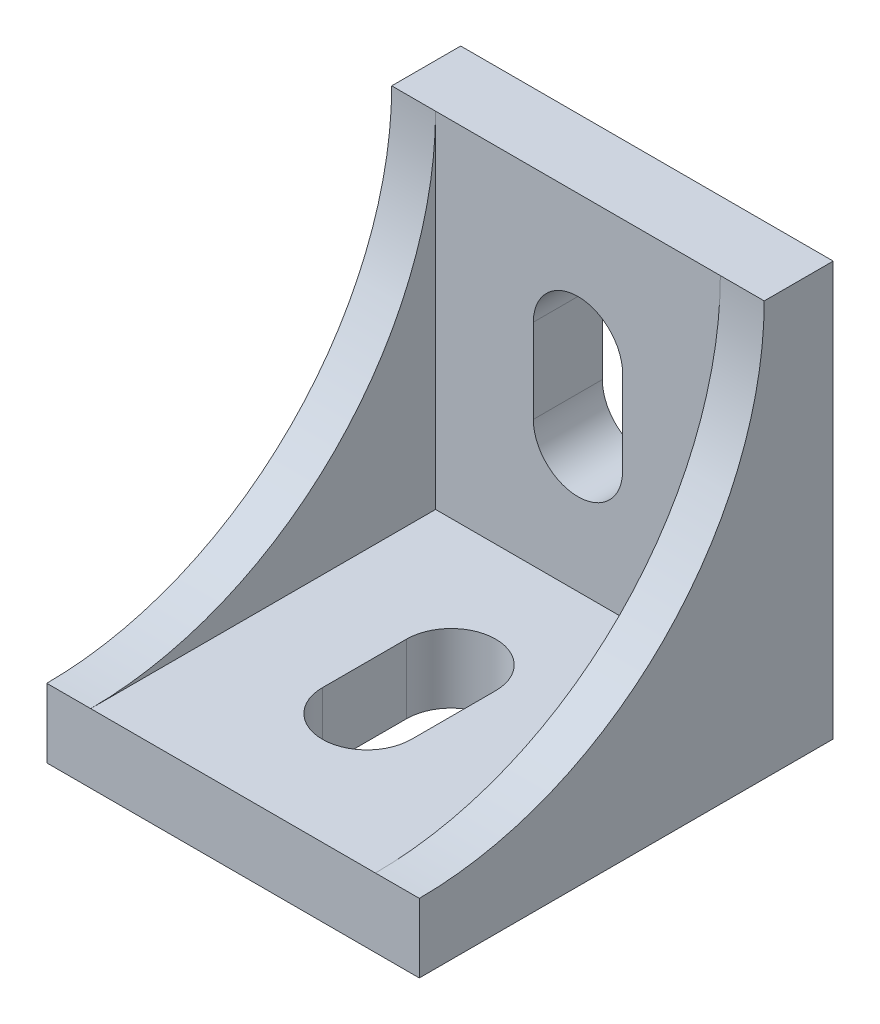
ISO-10303-21;
HEADER;
FILE_DESCRIPTION(('STEP AP214'),'2;1');
FILE_NAME('part.step','',(''),(''),'','','');
FILE_SCHEMA(('AUTOMOTIVE_DESIGN { 1 0 10303 214 1 1 1 1 }'));
ENDSEC;
DATA;
#1=APPLICATION_CONTEXT('core data for automotive mechanical design processes');
#2=APPLICATION_PROTOCOL_DEFINITION('international standard','automotive_design',2000,#1);
#3=PRODUCT_CONTEXT('',#1,'mechanical');
#4=PRODUCT('Part','Part','',(#3));
#5=PRODUCT_RELATED_PRODUCT_CATEGORY('part','',(#4));
#6=PRODUCT_DEFINITION_FORMATION('','',#4);
#7=PRODUCT_DEFINITION_CONTEXT('part definition',#1,'design');
#8=PRODUCT_DEFINITION('design','',#6,#7);
#9=PRODUCT_DEFINITION_SHAPE('','',#8);
#10=(LENGTH_UNIT() NAMED_UNIT(*) SI_UNIT(.MILLI.,.METRE.));
#11=(NAMED_UNIT(*) PLANE_ANGLE_UNIT() SI_UNIT($,.RADIAN.));
#12=(NAMED_UNIT(*) SI_UNIT($,.STERADIAN.) SOLID_ANGLE_UNIT());
#13=UNCERTAINTY_MEASURE_WITH_UNIT(LENGTH_MEASURE(1.E-05),#10,'distance_accuracy_value','');
#14=(GEOMETRIC_REPRESENTATION_CONTEXT(3) GLOBAL_UNCERTAINTY_ASSIGNED_CONTEXT((#13)) GLOBAL_UNIT_ASSIGNED_CONTEXT((#10,
#11,#12)) REPRESENTATION_CONTEXT('',''));
#15=CARTESIAN_POINT('',(0.,0.,0.));
#16=DIRECTION('',(0.,0.,1.));
#17=DIRECTION('',(1.,0.,0.));
#18=AXIS2_PLACEMENT_3D('',#15,#16,#17);
#19=CARTESIAN_POINT('',(-13.5,30.,-15.));
#20=DIRECTION('',(0.,0.,1.));
#21=DIRECTION('',(1.,0.,0.));
#22=AXIS2_PLACEMENT_3D('',#19,#20,#21);
#23=PLANE('',#22);
#24=DIRECTION('',(0.,-1.,0.));
#25=VECTOR('',#24,1.);
#26=CARTESIAN_POINT('',(3.,30.,-15.));
#27=LINE('',#26,#25);
#28=CARTESIAN_POINT('',(3.,26.9,-15.));
#29=VERTEX_POINT('',#28);
#30=CARTESIAN_POINT('',(3.,24.8,-15.));
#31=VERTEX_POINT('',#30);
#32=EDGE_CURVE('E512',#29,#31,#27,.T.);
#33=ORIENTED_EDGE('',*,*,#32,.F.);
#34=DIRECTION('',(1.,0.,0.));
#35=VECTOR('',#34,1.);
#36=CARTESIAN_POINT('',(-13.5,26.9,-15.));
#37=LINE('',#36,#35);
#38=CARTESIAN_POINT('',(-3.,26.9,-15.));
#39=VERTEX_POINT('',#38);
#40=EDGE_CURVE('E509',#39,#29,#37,.T.);
#41=ORIENTED_EDGE('',*,*,#40,.F.);
#42=DIRECTION('',(0.,1.,0.));
#43=VECTOR('',#42,1.);
#44=CARTESIAN_POINT('',(-3.,30.,-15.));
#45=LINE('',#44,#43);
#46=CARTESIAN_POINT('',(-3.,24.8,-15.));
#47=VERTEX_POINT('',#46);
#48=EDGE_CURVE('E506',#47,#39,#45,.T.);
#49=ORIENTED_EDGE('',*,*,#48,.F.);
#50=DIRECTION('',(-1.,0.,0.));
#51=VECTOR('',#50,1.);
#52=CARTESIAN_POINT('',(-13.5,24.8,-15.));
#53=LINE('',#52,#51);
#54=EDGE_CURVE('E503',#31,#47,#53,.T.);
#55=ORIENTED_EDGE('',*,*,#54,.F.);
#56=EDGE_LOOP('',(#33,#41,#49,#55));
#57=FACE_BOUND('',#56,.T.);
#58=DIRECTION('',(-1.,0.,0.));
#59=VECTOR('',#58,1.);
#60=CARTESIAN_POINT('',(-13.5,0.,-15.));
#61=LINE('',#60,#59);
#62=CARTESIAN_POINT('',(13.5,0.,-15.));
#63=VERTEX_POINT('',#62);
#64=CARTESIAN_POINT('',(-13.5,0.,-15.));
#65=VERTEX_POINT('',#64);
#66=EDGE_CURVE('E460',#63,#65,#61,.T.);
#67=ORIENTED_EDGE('',*,*,#66,.T.);
#68=DIRECTION('',(0.,-1.,0.));
#69=VECTOR('',#68,1.);
#70=CARTESIAN_POINT('',(-13.5,30.,-15.));
#71=LINE('',#70,#69);
#72=CARTESIAN_POINT('',(-13.5,30.,-15.));
#73=VERTEX_POINT('',#72);
#74=EDGE_CURVE('E470',#73,#65,#71,.T.);
#75=ORIENTED_EDGE('',*,*,#74,.F.);
#76=DIRECTION('',(-1.,0.,0.));
#77=VECTOR('',#76,1.);
#78=CARTESIAN_POINT('',(-13.5,30.,-15.));
#79=LINE('',#78,#77);
#80=CARTESIAN_POINT('',(13.5,30.,-15.));
#81=VERTEX_POINT('',#80);
#82=EDGE_CURVE('E451',#81,#73,#79,.T.);
#83=ORIENTED_EDGE('',*,*,#82,.F.);
#84=DIRECTION('',(0.,-1.,0.));
#85=VECTOR('',#84,1.);
#86=CARTESIAN_POINT('',(13.5,30.,-15.));
#87=LINE('',#86,#85);
#88=EDGE_CURVE('E473',#81,#63,#87,.T.);
#89=ORIENTED_EDGE('',*,*,#88,.T.);
#90=EDGE_LOOP('',(#67,#75,#83,#89));
#91=FACE_BOUND('',#90,.T.);
#92=DIRECTION('',(0.,-1.,0.));
#93=VECTOR('',#92,1.);
#94=CARTESIAN_POINT('',(3.235,14.195,-15.));
#95=LINE('',#94,#93);
#96=CARTESIAN_POINT('',(3.235,20.295,-15.));
#97=VERTEX_POINT('',#96);
#98=CARTESIAN_POINT('',(3.235,14.195,-15.));
#99=VERTEX_POINT('',#98);
#100=EDGE_CURVE('E371',#97,#99,#95,.T.);
#101=ORIENTED_EDGE('',*,*,#100,.F.);
#102=CARTESIAN_POINT('',(0.,20.295,-15.));
#103=DIRECTION('',(0.,0.,1.));
#104=DIRECTION('',(1.,0.,0.));
#105=AXIS2_PLACEMENT_3D('',#102,#103,#104);
#106=CIRCLE('',#105,3.235);
#107=CARTESIAN_POINT('',(-3.235,20.295,-15.));
#108=VERTEX_POINT('',#107);
#109=EDGE_CURVE('E373',#108,#97,#106,.F.);
#110=ORIENTED_EDGE('',*,*,#109,.F.);
#111=DIRECTION('',(0.,1.,0.));
#112=VECTOR('',#111,1.);
#113=CARTESIAN_POINT('',(-3.235,14.195,-15.));
#114=LINE('',#113,#112);
#115=CARTESIAN_POINT('',(-3.235,14.195,-15.));
#116=VERTEX_POINT('',#115);
#117=EDGE_CURVE('E365',#116,#108,#114,.T.);
#118=ORIENTED_EDGE('',*,*,#117,.F.);
#119=CARTESIAN_POINT('',(0.,14.195,-15.));
#120=DIRECTION('',(0.,0.,1.));
#121=DIRECTION('',(1.,0.,0.));
#122=AXIS2_PLACEMENT_3D('',#119,#120,#121);
#123=CIRCLE('',#122,3.235);
#124=EDGE_CURVE('E368',#99,#116,#123,.F.);
#125=ORIENTED_EDGE('',*,*,#124,.F.);
#126=EDGE_LOOP('',(#101,#110,#118,#125));
#127=FACE_BOUND('',#126,.T.);
#128=DIRECTION('',(0.,-1.,0.));
#129=VECTOR('',#128,1.);
#130=CARTESIAN_POINT('',(3.,30.,-15.));
#131=LINE('',#130,#129);
#132=CARTESIAN_POINT('',(3.,5.48,-15.));
#133=VERTEX_POINT('',#132);
#134=CARTESIAN_POINT('',(3.,3.38,-15.));
#135=VERTEX_POINT('',#134);
#136=EDGE_CURVE('E12',#133,#135,#131,.T.);
#137=ORIENTED_EDGE('',*,*,#136,.F.);
#138=DIRECTION('',(1.,0.,0.));
#139=VECTOR('',#138,1.);
#140=CARTESIAN_POINT('',(-13.5,5.48,-15.));
#141=LINE('',#140,#139);
#142=CARTESIAN_POINT('',(-3.,5.48,-15.));
#143=VERTEX_POINT('',#142);
#144=EDGE_CURVE('E45',#143,#133,#141,.T.);
#145=ORIENTED_EDGE('',*,*,#144,.F.);
#146=DIRECTION('',(0.,1.,0.));
#147=VECTOR('',#146,1.);
#148=CARTESIAN_POINT('',(-3.,30.,-15.));
#149=LINE('',#148,#147);
#150=CARTESIAN_POINT('',(-3.,3.38,-15.));
#151=VERTEX_POINT('',#150);
#152=EDGE_CURVE('E518',#151,#143,#149,.T.);
#153=ORIENTED_EDGE('',*,*,#152,.F.);
#154=DIRECTION('',(-1.,0.,0.));
#155=VECTOR('',#154,1.);
#156=CARTESIAN_POINT('',(-13.5,3.38,-15.));
#157=LINE('',#156,#155);
#158=EDGE_CURVE('E515',#135,#151,#157,.T.);
#159=ORIENTED_EDGE('',*,*,#158,.F.);
#160=EDGE_LOOP('',(#137,#145,#153,#159));
#161=FACE_BOUND('',#160,.T.);
#162=ADVANCED_FACE('F37',(#57,#91,#127,#161),#23,.F.);
#163=CARTESIAN_POINT('',(0.,0.,0.));
#164=DIRECTION('',(0.,-1.,0.));
#165=DIRECTION('',(0.,0.,-1.));
#166=AXIS2_PLACEMENT_3D('',#163,#164,#165);
#167=PLANE('',#166);
#168=CARTESIAN_POINT('',(0.,0.,-0.805000000000004));
#169=DIRECTION('',(0.,1.,0.));
#170=DIRECTION('',(0.,0.,1.));
#171=AXIS2_PLACEMENT_3D('',#168,#169,#170);
#172=CIRCLE('',#171,3.235);
#173=CARTESIAN_POINT('',(3.235,0.,-0.805000000000004));
#174=VERTEX_POINT('',#173);
#175=CARTESIAN_POINT('',(-3.235,0.,-0.805000000000004));
#176=VERTEX_POINT('',#175);
#177=EDGE_CURVE('E333',#174,#176,#172,.T.);
#178=ORIENTED_EDGE('',*,*,#177,.T.);
#179=DIRECTION('',(0.,0.,1.));
#180=VECTOR('',#179,1.);
#181=CARTESIAN_POINT('',(-3.235,0.,-0.805000000000004));
#182=LINE('',#181,#180);
#183=CARTESIAN_POINT('',(-3.235,0.,5.29499999999999));
#184=VERTEX_POINT('',#183);
#185=EDGE_CURVE('E336',#176,#184,#182,.T.);
#186=ORIENTED_EDGE('',*,*,#185,.T.);
#187=CARTESIAN_POINT('',(0.,0.,5.295));
#188=DIRECTION('',(0.,1.,0.));
#189=DIRECTION('',(0.,0.,1.));
#190=AXIS2_PLACEMENT_3D('',#187,#188,#189);
#191=CIRCLE('',#190,3.235);
#192=CARTESIAN_POINT('',(3.235,0.,5.295));
#193=VERTEX_POINT('',#192);
#194=EDGE_CURVE('E340',#184,#193,#191,.T.);
#195=ORIENTED_EDGE('',*,*,#194,.T.);
#196=DIRECTION('',(0.,0.,-1.));
#197=VECTOR('',#196,1.);
#198=CARTESIAN_POINT('',(3.235,0.,-0.805000000000004));
#199=LINE('',#198,#197);
#200=EDGE_CURVE('E343',#193,#174,#199,.T.);
#201=ORIENTED_EDGE('',*,*,#200,.T.);
#202=EDGE_LOOP('',(#178,#186,#195,#201));
#203=FACE_BOUND('',#202,.T.);
#204=DIRECTION('',(0.,0.,-1.));
#205=VECTOR('',#204,1.);
#206=CARTESIAN_POINT('',(13.5,0.,15.));
#207=LINE('',#206,#205);
#208=CARTESIAN_POINT('',(13.5,0.,15.));
#209=VERTEX_POINT('',#208);
#210=EDGE_CURVE('E448',#209,#63,#207,.T.);
#211=ORIENTED_EDGE('',*,*,#210,.F.);
#212=DIRECTION('',(1.,0.,0.));
#213=VECTOR('',#212,1.);
#214=CARTESIAN_POINT('',(-13.5,0.,15.));
#215=LINE('',#214,#213);
#216=CARTESIAN_POINT('',(-13.5,0.,15.));
#217=VERTEX_POINT('',#216);
#218=EDGE_CURVE('E452',#217,#209,#215,.T.);
#219=ORIENTED_EDGE('',*,*,#218,.F.);
#220=DIRECTION('',(0.,0.,1.));
#221=VECTOR('',#220,1.);
#222=CARTESIAN_POINT('',(-13.5,0.,15.));
#223=LINE('',#222,#221);
#224=EDGE_CURVE('E462',#65,#217,#223,.T.);
#225=ORIENTED_EDGE('',*,*,#224,.F.);
#226=ORIENTED_EDGE('',*,*,#66,.F.);
#227=EDGE_LOOP('',(#211,#219,#225,#226));
#228=FACE_BOUND('',#227,.T.);
#229=DIRECTION('',(1.,0.,0.));
#230=VECTOR('',#229,1.);
#231=CARTESIAN_POINT('',(0.,0.,11.9));
#232=LINE('',#231,#230);
#233=CARTESIAN_POINT('',(-3.,0.,11.9));
#234=VERTEX_POINT('',#233);
#235=CARTESIAN_POINT('',(3.,0.,11.9));
#236=VERTEX_POINT('',#235);
#237=EDGE_CURVE('E485',#234,#236,#232,.T.);
#238=ORIENTED_EDGE('',*,*,#237,.T.);
#239=DIRECTION('',(0.,0.,-1.));
#240=VECTOR('',#239,1.);
#241=CARTESIAN_POINT('',(3.,0.,0.));
#242=LINE('',#241,#240);
#243=CARTESIAN_POINT('',(3.,0.,9.8));
#244=VERTEX_POINT('',#243);
#245=EDGE_CURVE('E488',#236,#244,#242,.T.);
#246=ORIENTED_EDGE('',*,*,#245,.T.);
#247=DIRECTION('',(-1.,0.,0.));
#248=VECTOR('',#247,1.);
#249=CARTESIAN_POINT('',(0.,0.,9.8));
#250=LINE('',#249,#248);
#251=CARTESIAN_POINT('',(-3.,0.,9.8));
#252=VERTEX_POINT('',#251);
#253=EDGE_CURVE('E479',#244,#252,#250,.T.);
#254=ORIENTED_EDGE('',*,*,#253,.T.);
#255=DIRECTION('',(0.,0.,1.));
#256=VECTOR('',#255,1.);
#257=CARTESIAN_POINT('',(-3.,0.,0.));
#258=LINE('',#257,#256);
#259=EDGE_CURVE('E482',#252,#234,#258,.T.);
#260=ORIENTED_EDGE('',*,*,#259,.T.);
#261=EDGE_LOOP('',(#238,#246,#254,#260));
#262=FACE_BOUND('',#261,.T.);
#263=DIRECTION('',(1.,0.,0.));
#264=VECTOR('',#263,1.);
#265=CARTESIAN_POINT('',(0.,0.,-9.52));
#266=LINE('',#265,#264);
#267=CARTESIAN_POINT('',(-3.,0.,-9.52));
#268=VERTEX_POINT('',#267);
#269=CARTESIAN_POINT('',(3.,0.,-9.52));
#270=VERTEX_POINT('',#269);
#271=EDGE_CURVE('E497',#268,#270,#266,.T.);
#272=ORIENTED_EDGE('',*,*,#271,.T.);
#273=DIRECTION('',(0.,0.,-1.));
#274=VECTOR('',#273,1.);
#275=CARTESIAN_POINT('',(3.,0.,0.));
#276=LINE('',#275,#274);
#277=CARTESIAN_POINT('',(3.,0.,-11.62));
#278=VERTEX_POINT('',#277);
#279=EDGE_CURVE('E500',#270,#278,#276,.T.);
#280=ORIENTED_EDGE('',*,*,#279,.T.);
#281=DIRECTION('',(-1.,0.,0.));
#282=VECTOR('',#281,1.);
#283=CARTESIAN_POINT('',(0.,0.,-11.62));
#284=LINE('',#283,#282);
#285=CARTESIAN_POINT('',(-3.,0.,-11.62));
#286=VERTEX_POINT('',#285);
#287=EDGE_CURVE('E491',#278,#286,#284,.T.);
#288=ORIENTED_EDGE('',*,*,#287,.T.);
#289=DIRECTION('',(0.,0.,1.));
#290=VECTOR('',#289,1.);
#291=CARTESIAN_POINT('',(-3.,0.,0.));
#292=LINE('',#291,#290);
#293=EDGE_CURVE('E494',#286,#268,#292,.T.);
#294=ORIENTED_EDGE('',*,*,#293,.T.);
#295=EDGE_LOOP('',(#272,#280,#288,#294));
#296=FACE_BOUND('',#295,.T.);
#297=ADVANCED_FACE('F533',(#203,#228,#262,#296),#167,.T.);
#298=CARTESIAN_POINT('',(13.5,30.,15.));
#299=DIRECTION('',(-1.,0.,0.));
#300=DIRECTION('',(0.,0.,1.));
#301=AXIS2_PLACEMENT_3D('',#298,#299,#300);
#302=PLANE('',#301);
#303=DIRECTION('',(0.,0.,-1.));
#304=VECTOR('',#303,1.);
#305=CARTESIAN_POINT('',(13.5,30.,15.));
#306=LINE('',#305,#304);
#307=CARTESIAN_POINT('',(13.5,30.,-10.));
#308=VERTEX_POINT('',#307);
#309=EDGE_CURVE('E449',#308,#81,#306,.T.);
#310=ORIENTED_EDGE('',*,*,#309,.F.);
#311=CARTESIAN_POINT('',(13.5,30.,15.));
#312=DIRECTION('',(1.,0.,0.));
#313=DIRECTION('',(0.,0.,1.));
#314=AXIS2_PLACEMENT_3D('',#311,#312,#313);
#315=CIRCLE('',#314,25.);
#316=CARTESIAN_POINT('',(13.5,5.,15.));
#317=VERTEX_POINT('',#316);
#318=EDGE_CURVE('E412',#317,#308,#315,.T.);
#319=ORIENTED_EDGE('',*,*,#318,.F.);
#320=DIRECTION('',(0.,-1.,0.));
#321=VECTOR('',#320,1.);
#322=CARTESIAN_POINT('',(13.5,30.,15.));
#323=LINE('',#322,#321);
#324=EDGE_CURVE('E457',#317,#209,#323,.T.);
#325=ORIENTED_EDGE('',*,*,#324,.T.);
#326=ORIENTED_EDGE('',*,*,#210,.T.);
#327=ORIENTED_EDGE('',*,*,#88,.F.);
#328=EDGE_LOOP('',(#310,#319,#325,#326,#327));
#329=FACE_BOUND('',#328,.T.);
#330=ADVANCED_FACE('F39',(#329),#302,.F.);
#331=CARTESIAN_POINT('',(-13.5,30.,15.));
#332=DIRECTION('',(1.,0.,0.));
#333=DIRECTION('',(0.,0.,-1.));
#334=AXIS2_PLACEMENT_3D('',#331,#332,#333);
#335=PLANE('',#334);
#336=DIRECTION('',(0.,-1.,0.));
#337=VECTOR('',#336,1.);
#338=CARTESIAN_POINT('',(-13.5,30.,15.));
#339=LINE('',#338,#337);
#340=CARTESIAN_POINT('',(-13.5,5.,15.));
#341=VERTEX_POINT('',#340);
#342=EDGE_CURVE('E468',#341,#217,#339,.T.);
#343=ORIENTED_EDGE('',*,*,#342,.F.);
#344=CARTESIAN_POINT('',(-13.5,30.,15.));
#345=DIRECTION('',(1.,0.,0.));
#346=DIRECTION('',(0.,0.,1.));
#347=AXIS2_PLACEMENT_3D('',#344,#345,#346);
#348=CIRCLE('',#347,25.);
#349=CARTESIAN_POINT('',(-13.5,30.,-10.));
#350=VERTEX_POINT('',#349);
#351=EDGE_CURVE('E414',#341,#350,#348,.T.);
#352=ORIENTED_EDGE('',*,*,#351,.T.);
#353=DIRECTION('',(0.,0.,1.));
#354=VECTOR('',#353,1.);
#355=CARTESIAN_POINT('',(-13.5,30.,15.));
#356=LINE('',#355,#354);
#357=EDGE_CURVE('E454',#73,#350,#356,.T.);
#358=ORIENTED_EDGE('',*,*,#357,.F.);
#359=ORIENTED_EDGE('',*,*,#74,.T.);
#360=ORIENTED_EDGE('',*,*,#224,.T.);
#361=EDGE_LOOP('',(#343,#352,#358,#359,#360));
#362=FACE_BOUND('',#361,.T.);
#363=ADVANCED_FACE('F542',(#362),#335,.F.);
#364=CARTESIAN_POINT('',(-13.5,30.,15.));
#365=DIRECTION('',(0.,0.,-1.));
#366=DIRECTION('',(-1.,0.,0.));
#367=AXIS2_PLACEMENT_3D('',#364,#365,#366);
#368=PLANE('',#367);
#369=ORIENTED_EDGE('',*,*,#324,.F.);
#370=DIRECTION('',(1.,0.,0.));
#371=VECTOR('',#370,1.);
#372=CARTESIAN_POINT('',(-13.5,5.,15.));
#373=LINE('',#372,#371);
#374=CARTESIAN_POINT('',(10.32,5.,15.));
#375=VERTEX_POINT('',#374);
#376=EDGE_CURVE('E417',#375,#317,#373,.T.);
#377=ORIENTED_EDGE('',*,*,#376,.F.);
#378=DIRECTION('',(1.,0.,0.));
#379=VECTOR('',#378,1.);
#380=CARTESIAN_POINT('',(-10.32,5.,15.));
#381=LINE('',#380,#379);
#382=CARTESIAN_POINT('',(-10.32,5.,15.));
#383=VERTEX_POINT('',#382);
#384=EDGE_CURVE('E438',#383,#375,#381,.T.);
#385=ORIENTED_EDGE('',*,*,#384,.F.);
#386=EDGE_CURVE('E423',#341,#383,#373,.T.);
#387=ORIENTED_EDGE('',*,*,#386,.F.);
#388=ORIENTED_EDGE('',*,*,#342,.T.);
#389=ORIENTED_EDGE('',*,*,#218,.T.);
#390=EDGE_LOOP('',(#369,#377,#385,#387,#388,#389));
#391=FACE_BOUND('',#390,.T.);
#392=ADVANCED_FACE('F545',(#391),#368,.F.);
#393=CARTESIAN_POINT('',(0.,30.,0.));
#394=DIRECTION('',(0.,-1.,0.));
#395=DIRECTION('',(0.,0.,-1.));
#396=AXIS2_PLACEMENT_3D('',#393,#394,#395);
#397=PLANE('',#396);
#398=ORIENTED_EDGE('',*,*,#357,.T.);
#399=DIRECTION('',(1.,0.,0.));
#400=VECTOR('',#399,1.);
#401=CARTESIAN_POINT('',(-13.5,30.,-10.));
#402=LINE('',#401,#400);
#403=CARTESIAN_POINT('',(-10.32,30.,-10.));
#404=VERTEX_POINT('',#403);
#405=EDGE_CURVE('E418',#350,#404,#402,.T.);
#406=ORIENTED_EDGE('',*,*,#405,.T.);
#407=DIRECTION('',(-1.,0.,0.));
#408=VECTOR('',#407,1.);
#409=CARTESIAN_POINT('',(-10.32,30.,-10.));
#410=LINE('',#409,#408);
#411=CARTESIAN_POINT('',(10.32,30.,-9.99999999999999));
#412=VERTEX_POINT('',#411);
#413=EDGE_CURVE('E427',#412,#404,#410,.T.);
#414=ORIENTED_EDGE('',*,*,#413,.F.);
#415=EDGE_CURVE('E422',#412,#308,#402,.T.);
#416=ORIENTED_EDGE('',*,*,#415,.T.);
#417=ORIENTED_EDGE('',*,*,#309,.T.);
#418=ORIENTED_EDGE('',*,*,#82,.T.);
#419=EDGE_LOOP('',(#398,#406,#414,#416,#417,#418));
#420=FACE_BOUND('',#419,.T.);
#421=ADVANCED_FACE('F548',(#420),#397,.F.);
#422=CARTESIAN_POINT('',(0.,5.,0.));
#423=DIRECTION('',(0.,-1.,0.));
#424=DIRECTION('',(0.,0.,-1.));
#425=AXIS2_PLACEMENT_3D('',#422,#423,#424);
#426=PLANE('',#425);
#427=DIRECTION('',(0.,0.,1.));
#428=VECTOR('',#427,1.);
#429=CARTESIAN_POINT('',(-3.235,5.,-0.805000000000004));
#430=LINE('',#429,#428);
#431=CARTESIAN_POINT('',(-3.235,5.,-0.805000000000004));
#432=VERTEX_POINT('',#431);
#433=CARTESIAN_POINT('',(-3.235,5.,5.29499999999999));
#434=VERTEX_POINT('',#433);
#435=EDGE_CURVE('E348',#432,#434,#430,.T.);
#436=ORIENTED_EDGE('',*,*,#435,.F.);
#437=CARTESIAN_POINT('',(0.,5.,-0.805000000000004));
#438=DIRECTION('',(0.,1.,0.));
#439=DIRECTION('',(0.,0.,1.));
#440=AXIS2_PLACEMENT_3D('',#437,#438,#439);
#441=CIRCLE('',#440,3.235);
#442=CARTESIAN_POINT('',(3.235,5.,-0.805000000000004));
#443=VERTEX_POINT('',#442);
#444=EDGE_CURVE('E332',#443,#432,#441,.T.);
#445=ORIENTED_EDGE('',*,*,#444,.F.);
#446=DIRECTION('',(0.,0.,-1.));
#447=VECTOR('',#446,1.);
#448=CARTESIAN_POINT('',(3.235,5.,-0.805000000000004));
#449=LINE('',#448,#447);
#450=CARTESIAN_POINT('',(3.235,5.,5.295));
#451=VERTEX_POINT('',#450);
#452=EDGE_CURVE('E337',#451,#443,#449,.T.);
#453=ORIENTED_EDGE('',*,*,#452,.F.);
#454=CARTESIAN_POINT('',(0.,5.,5.295));
#455=DIRECTION('',(0.,1.,0.));
#456=DIRECTION('',(0.,0.,1.));
#457=AXIS2_PLACEMENT_3D('',#454,#455,#456);
#458=CIRCLE('',#457,3.235);
#459=EDGE_CURVE('E351',#434,#451,#458,.T.);
#460=ORIENTED_EDGE('',*,*,#459,.F.);
#461=EDGE_LOOP('',(#436,#445,#453,#460));
#462=FACE_BOUND('',#461,.T.);
#463=DIRECTION('',(0.,0.,-1.));
#464=VECTOR('',#463,1.);
#465=CARTESIAN_POINT('',(10.32,5.,-9.99999999999999));
#466=LINE('',#465,#464);
#467=CARTESIAN_POINT('',(10.32,5.,-9.99999999999999));
#468=VERTEX_POINT('',#467);
#469=EDGE_CURVE('E434',#375,#468,#466,.T.);
#470=ORIENTED_EDGE('',*,*,#469,.T.);
#471=DIRECTION('',(-1.,0.,0.));
#472=VECTOR('',#471,1.);
#473=CARTESIAN_POINT('',(-10.32,5.,-10.));
#474=LINE('',#473,#472);
#475=CARTESIAN_POINT('',(-10.32,5.,-10.));
#476=VERTEX_POINT('',#475);
#477=EDGE_CURVE('E430',#468,#476,#474,.T.);
#478=ORIENTED_EDGE('',*,*,#477,.T.);
#479=DIRECTION('',(0.,0.,1.));
#480=VECTOR('',#479,1.);
#481=CARTESIAN_POINT('',(-10.32,5.,-10.));
#482=LINE('',#481,#480);
#483=EDGE_CURVE('E441',#476,#383,#482,.T.);
#484=ORIENTED_EDGE('',*,*,#483,.T.);
#485=ORIENTED_EDGE('',*,*,#384,.T.);
#486=EDGE_LOOP('',(#470,#478,#484,#485));
#487=FACE_BOUND('',#486,.T.);
#488=ADVANCED_FACE('F553',(#462,#487),#426,.F.);
#489=CARTESIAN_POINT('',(-10.32,-32.4192782152842,-10.));
#490=DIRECTION('',(0.,0.,-1.));
#491=DIRECTION('',(-1.,0.,0.));
#492=AXIS2_PLACEMENT_3D('',#489,#490,#491);
#493=PLANE('',#492);
#494=CARTESIAN_POINT('',(0.,20.295,-9.9999999999966));
#495=DIRECTION('',(0.,3.75203100833626E-13,-1.));
#496=DIRECTION('',(0.,1.,3.75203100833626E-13));
#497=AXIS2_PLACEMENT_3D('',#494,#495,#496);
#498=CIRCLE('',#497,3.235);
#499=CARTESIAN_POINT('',(-3.235,20.295,-9.9999999999966));
#500=VERTEX_POINT('',#499);
#501=CARTESIAN_POINT('',(3.235,20.295,-9.99999999999999));
#502=VERTEX_POINT('',#501);
#503=EDGE_CURVE('E378',#500,#502,#498,.T.);
#504=ORIENTED_EDGE('',*,*,#503,.T.);
#505=DIRECTION('',(0.,-1.,-3.75203100833626E-13));
#506=VECTOR('',#505,1.);
#507=CARTESIAN_POINT('',(3.235,14.195,-9.99999999999889));
#508=LINE('',#507,#506);
#509=CARTESIAN_POINT('',(3.235,14.195,-9.99999999999889));
#510=VERTEX_POINT('',#509);
#511=EDGE_CURVE('E381',#502,#510,#508,.T.);
#512=ORIENTED_EDGE('',*,*,#511,.T.);
#513=CARTESIAN_POINT('',(0.,14.195,-9.99999999999889));
#514=DIRECTION('',(0.,3.75203100833626E-13,-1.));
#515=DIRECTION('',(0.,1.,3.75203100833626E-13));
#516=AXIS2_PLACEMENT_3D('',#513,#514,#515);
#517=CIRCLE('',#516,3.235);
#518=CARTESIAN_POINT('',(-3.235,14.195,-9.99999999999889));
#519=VERTEX_POINT('',#518);
#520=EDGE_CURVE('E391',#510,#519,#517,.T.);
#521=ORIENTED_EDGE('',*,*,#520,.T.);
#522=DIRECTION('',(0.,1.,3.75203100833626E-13));
#523=VECTOR('',#522,1.);
#524=CARTESIAN_POINT('',(-3.235,14.195,-9.99999999999889));
#525=LINE('',#524,#523);
#526=EDGE_CURVE('E401',#519,#500,#525,.T.);
#527=ORIENTED_EDGE('',*,*,#526,.T.);
#528=EDGE_LOOP('',(#504,#512,#521,#527));
#529=FACE_BOUND('',#528,.T.);
#530=DIRECTION('',(0.,1.,0.));
#531=VECTOR('',#530,1.);
#532=CARTESIAN_POINT('',(10.32,-32.4192782152842,-9.99999999999999));
#533=LINE('',#532,#531);
#534=EDGE_CURVE('E437',#468,#412,#533,.T.);
#535=ORIENTED_EDGE('',*,*,#534,.T.);
#536=ORIENTED_EDGE('',*,*,#413,.T.);
#537=DIRECTION('',(0.,1.,0.));
#538=VECTOR('',#537,1.);
#539=CARTESIAN_POINT('',(-10.32,-32.4192782152842,-10.));
#540=LINE('',#539,#538);
#541=EDGE_CURVE('E433',#476,#404,#540,.T.);
#542=ORIENTED_EDGE('',*,*,#541,.F.);
#543=ORIENTED_EDGE('',*,*,#477,.F.);
#544=EDGE_LOOP('',(#535,#536,#542,#543));
#545=FACE_BOUND('',#544,.T.);
#546=ADVANCED_FACE('F557',(#529,#545),#493,.F.);
#547=CARTESIAN_POINT('',(-10.32,-32.4192782152842,-10.));
#548=DIRECTION('',(-1.,0.,0.));
#549=DIRECTION('',(0.,0.,1.));
#550=AXIS2_PLACEMENT_3D('',#547,#548,#549);
#551=PLANE('',#550);
#552=ORIENTED_EDGE('',*,*,#541,.T.);
#553=CARTESIAN_POINT('',(-10.32,30.,15.));
#554=DIRECTION('',(-1.,0.,0.));
#555=DIRECTION('',(0.,0.,1.));
#556=AXIS2_PLACEMENT_3D('',#553,#554,#555);
#557=CIRCLE('',#556,25.);
#558=EDGE_CURVE('E421',#404,#383,#557,.T.);
#559=ORIENTED_EDGE('',*,*,#558,.T.);
#560=ORIENTED_EDGE('',*,*,#483,.F.);
#561=EDGE_LOOP('',(#552,#559,#560));
#562=FACE_BOUND('',#561,.T.);
#563=ADVANCED_FACE('F561',(#562),#551,.F.);
#564=CARTESIAN_POINT('',(10.32,-32.4192782152842,-9.99999999999999));
#565=DIRECTION('',(1.,0.,0.));
#566=DIRECTION('',(0.,0.,-1.));
#567=AXIS2_PLACEMENT_3D('',#564,#565,#566);
#568=PLANE('',#567);
#569=ORIENTED_EDGE('',*,*,#469,.F.);
#570=CARTESIAN_POINT('',(10.32,30.,15.));
#571=DIRECTION('',(1.,0.,0.));
#572=DIRECTION('',(0.,0.,-1.));
#573=AXIS2_PLACEMENT_3D('',#570,#571,#572);
#574=CIRCLE('',#573,25.);
#575=EDGE_CURVE('E476',#375,#412,#574,.T.);
#576=ORIENTED_EDGE('',*,*,#575,.T.);
#577=ORIENTED_EDGE('',*,*,#534,.F.);
#578=EDGE_LOOP('',(#569,#576,#577));
#579=FACE_BOUND('',#578,.T.);
#580=ADVANCED_FACE('F565',(#579),#568,.F.);
#581=CARTESIAN_POINT('',(-13.5,30.,15.));
#582=DIRECTION('',(1.,0.,0.));
#583=DIRECTION('',(0.,0.,-1.));
#584=AXIS2_PLACEMENT_3D('',#581,#582,#583);
#585=CYLINDRICAL_SURFACE('',#584,25.);
#586=ORIENTED_EDGE('',*,*,#376,.T.);
#587=ORIENTED_EDGE('',*,*,#318,.T.);
#588=ORIENTED_EDGE('',*,*,#415,.F.);
#589=ORIENTED_EDGE('',*,*,#575,.F.);
#590=EDGE_LOOP('',(#586,#587,#588,#589));
#591=FACE_BOUND('',#590,.T.);
#592=ADVANCED_FACE('F569',(#591),#585,.F.);
#593=ORIENTED_EDGE('',*,*,#405,.F.);
#594=ORIENTED_EDGE('',*,*,#351,.F.);
#595=ORIENTED_EDGE('',*,*,#386,.T.);
#596=ORIENTED_EDGE('',*,*,#558,.F.);
#597=EDGE_LOOP('',(#593,#594,#595,#596));
#598=FACE_BOUND('',#597,.T.);
#599=ADVANCED_FACE('F571',(#598),#585,.F.);
#600=CARTESIAN_POINT('',(3.235,14.195,-9.99999999999889));
#601=DIRECTION('',(1.,0.,0.));
#602=DIRECTION('',(0.,1.,0.));
#603=AXIS2_PLACEMENT_3D('',#600,#601,#602);
#604=PLANE('',#603);
#605=ORIENTED_EDGE('',*,*,#100,.T.);
#606=DIRECTION('',(0.,0.,-1.));
#607=VECTOR('',#606,1.);
#608=CARTESIAN_POINT('',(3.235,14.195,-9.99999999999889));
#609=LINE('',#608,#607);
#610=EDGE_CURVE('E358',#510,#99,#609,.T.);
#611=ORIENTED_EDGE('',*,*,#610,.F.);
#612=ORIENTED_EDGE('',*,*,#511,.F.);
#613=DIRECTION('',(0.,0.,-1.));
#614=VECTOR('',#613,1.);
#615=CARTESIAN_POINT('',(3.235,20.295,-9.9999999999966));
#616=LINE('',#615,#614);
#617=EDGE_CURVE('E369',#502,#97,#616,.T.);
#618=ORIENTED_EDGE('',*,*,#617,.T.);
#619=EDGE_LOOP('',(#605,#611,#612,#618));
#620=FACE_BOUND('',#619,.T.);
#621=ADVANCED_FACE('F574',(#620),#604,.F.);
#622=CARTESIAN_POINT('',(0.,14.195,-9.99999999999889));
#623=DIRECTION('',(0.,0.,-1.));
#624=DIRECTION('',(-1.,0.,0.));
#625=AXIS2_PLACEMENT_3D('',#622,#623,#624);
#626=CYLINDRICAL_SURFACE('',#625,3.235);
#627=ORIENTED_EDGE('',*,*,#124,.T.);
#628=DIRECTION('',(0.,0.,-1.));
#629=VECTOR('',#628,1.);
#630=CARTESIAN_POINT('',(-3.235,14.195,-9.99999999999889));
#631=LINE('',#630,#629);
#632=EDGE_CURVE('E384',#519,#116,#631,.T.);
#633=ORIENTED_EDGE('',*,*,#632,.F.);
#634=ORIENTED_EDGE('',*,*,#520,.F.);
#635=ORIENTED_EDGE('',*,*,#610,.T.);
#636=EDGE_LOOP('',(#627,#633,#634,#635));
#637=FACE_BOUND('',#636,.T.);
#638=ADVANCED_FACE('F579',(#637),#626,.F.);
#639=CARTESIAN_POINT('',(-3.235,14.195,-9.99999999999889));
#640=DIRECTION('',(-1.,0.,0.));
#641=DIRECTION('',(0.,-1.,0.));
#642=AXIS2_PLACEMENT_3D('',#639,#640,#641);
#643=PLANE('',#642);
#644=ORIENTED_EDGE('',*,*,#117,.T.);
#645=DIRECTION('',(0.,0.,-1.));
#646=VECTOR('',#645,1.);
#647=CARTESIAN_POINT('',(-3.235,20.295,-9.9999999999966));
#648=LINE('',#647,#646);
#649=EDGE_CURVE('E394',#500,#108,#648,.T.);
#650=ORIENTED_EDGE('',*,*,#649,.F.);
#651=ORIENTED_EDGE('',*,*,#526,.F.);
#652=ORIENTED_EDGE('',*,*,#632,.T.);
#653=EDGE_LOOP('',(#644,#650,#651,#652));
#654=FACE_BOUND('',#653,.T.);
#655=ADVANCED_FACE('F584',(#654),#643,.F.);
#656=CARTESIAN_POINT('',(0.,20.295,-9.9999999999966));
#657=DIRECTION('',(0.,0.,-1.));
#658=DIRECTION('',(-1.,0.,0.));
#659=AXIS2_PLACEMENT_3D('',#656,#657,#658);
#660=CYLINDRICAL_SURFACE('',#659,3.235);
#661=ORIENTED_EDGE('',*,*,#109,.T.);
#662=ORIENTED_EDGE('',*,*,#617,.F.);
#663=ORIENTED_EDGE('',*,*,#503,.F.);
#664=ORIENTED_EDGE('',*,*,#649,.T.);
#665=EDGE_LOOP('',(#661,#662,#663,#664));
#666=FACE_BOUND('',#665,.T.);
#667=ADVANCED_FACE('F576',(#666),#660,.F.);
#668=CARTESIAN_POINT('',(0.,0.,-0.805000000000004));
#669=DIRECTION('',(0.,1.,0.));
#670=DIRECTION('',(0.,0.,1.));
#671=AXIS2_PLACEMENT_3D('',#668,#669,#670);
#672=CYLINDRICAL_SURFACE('',#671,3.235);
#673=ORIENTED_EDGE('',*,*,#444,.T.);
#674=DIRECTION('',(0.,1.,0.));
#675=VECTOR('',#674,1.);
#676=CARTESIAN_POINT('',(-3.235,0.,-0.805000000000004));
#677=LINE('',#676,#675);
#678=EDGE_CURVE('E346',#176,#432,#677,.T.);
#679=ORIENTED_EDGE('',*,*,#678,.F.);
#680=ORIENTED_EDGE('',*,*,#177,.F.);
#681=DIRECTION('',(0.,1.,0.));
#682=VECTOR('',#681,1.);
#683=CARTESIAN_POINT('',(3.235,0.,-0.805000000000004));
#684=LINE('',#683,#682);
#685=EDGE_CURVE('E356',#174,#443,#684,.T.);
#686=ORIENTED_EDGE('',*,*,#685,.T.);
#687=EDGE_LOOP('',(#673,#679,#680,#686));
#688=FACE_BOUND('',#687,.T.);
#689=ADVANCED_FACE('F581',(#688),#672,.F.);
#690=CARTESIAN_POINT('',(3.235,0.,-0.805000000000004));
#691=DIRECTION('',(1.,0.,0.));
#692=DIRECTION('',(0.,0.,-1.));
#693=AXIS2_PLACEMENT_3D('',#690,#691,#692);
#694=PLANE('',#693);
#695=ORIENTED_EDGE('',*,*,#452,.T.);
#696=ORIENTED_EDGE('',*,*,#685,.F.);
#697=ORIENTED_EDGE('',*,*,#200,.F.);
#698=DIRECTION('',(0.,1.,0.));
#699=VECTOR('',#698,1.);
#700=CARTESIAN_POINT('',(3.235,0.,5.295));
#701=LINE('',#700,#699);
#702=EDGE_CURVE('E359',#193,#451,#701,.T.);
#703=ORIENTED_EDGE('',*,*,#702,.T.);
#704=EDGE_LOOP('',(#695,#696,#697,#703));
#705=FACE_BOUND('',#704,.T.);
#706=ADVANCED_FACE('F594',(#705),#694,.F.);
#707=CARTESIAN_POINT('',(0.,0.,5.295));
#708=DIRECTION('',(0.,1.,0.));
#709=DIRECTION('',(0.,0.,1.));
#710=AXIS2_PLACEMENT_3D('',#707,#708,#709);
#711=CYLINDRICAL_SURFACE('',#710,3.235);
#712=ORIENTED_EDGE('',*,*,#459,.T.);
#713=ORIENTED_EDGE('',*,*,#702,.F.);
#714=ORIENTED_EDGE('',*,*,#194,.F.);
#715=DIRECTION('',(0.,1.,0.));
#716=VECTOR('',#715,1.);
#717=CARTESIAN_POINT('',(-3.235,0.,5.29499999999999));
#718=LINE('',#717,#716);
#719=EDGE_CURVE('E361',#184,#434,#718,.T.);
#720=ORIENTED_EDGE('',*,*,#719,.T.);
#721=EDGE_LOOP('',(#712,#713,#714,#720));
#722=FACE_BOUND('',#721,.T.);
#723=ADVANCED_FACE('F600',(#722),#711,.F.);
#724=CARTESIAN_POINT('',(-3.235,0.,-0.805000000000004));
#725=DIRECTION('',(-1.,0.,0.));
#726=DIRECTION('',(0.,0.,1.));
#727=AXIS2_PLACEMENT_3D('',#724,#725,#726);
#728=PLANE('',#727);
#729=ORIENTED_EDGE('',*,*,#435,.T.);
#730=ORIENTED_EDGE('',*,*,#719,.F.);
#731=ORIENTED_EDGE('',*,*,#185,.F.);
#732=ORIENTED_EDGE('',*,*,#678,.T.);
#733=EDGE_LOOP('',(#729,#730,#731,#732));
#734=FACE_BOUND('',#733,.T.);
#735=ADVANCED_FACE('F596',(#734),#728,.F.);
#736=CARTESIAN_POINT('',(3.,-1.65,11.9));
#737=DIRECTION('',(-1.,0.,0.));
#738=DIRECTION('',(0.,0.,1.));
#739=AXIS2_PLACEMENT_3D('',#736,#737,#738);
#740=PLANE('',#739);
#741=ORIENTED_EDGE('',*,*,#245,.F.);
#742=DIRECTION('',(0.,1.,0.));
#743=VECTOR('',#742,1.);
#744=CARTESIAN_POINT('',(3.,-1.65,11.9));
#745=LINE('',#744,#743);
#746=CARTESIAN_POINT('',(3.,-1.65,11.9));
#747=VERTEX_POINT('',#746);
#748=EDGE_CURVE('E329',#747,#236,#745,.T.);
#749=ORIENTED_EDGE('',*,*,#748,.F.);
#750=DIRECTION('',(0.,0.,1.));
#751=VECTOR('',#750,1.);
#752=CARTESIAN_POINT('',(3.,-1.65,11.9));
#753=LINE('',#752,#751);
#754=CARTESIAN_POINT('',(3.,-1.65,9.8));
#755=VERTEX_POINT('',#754);
#756=EDGE_CURVE('E312',#755,#747,#753,.T.);
#757=ORIENTED_EDGE('',*,*,#756,.F.);
#758=DIRECTION('',(0.,1.,0.));
#759=VECTOR('',#758,1.);
#760=CARTESIAN_POINT('',(3.,-1.65,9.8));
#761=LINE('',#760,#759);
#762=EDGE_CURVE('E321',#755,#244,#761,.T.);
#763=ORIENTED_EDGE('',*,*,#762,.T.);
#764=EDGE_LOOP('',(#741,#749,#757,#763));
#765=FACE_BOUND('',#764,.T.);
#766=ADVANCED_FACE('F599',(#765),#740,.F.);
#767=CARTESIAN_POINT('',(-3.,-1.65,11.9));
#768=DIRECTION('',(0.,0.,-1.));
#769=DIRECTION('',(-1.,0.,0.));
#770=AXIS2_PLACEMENT_3D('',#767,#768,#769);
#771=PLANE('',#770);
#772=ORIENTED_EDGE('',*,*,#237,.F.);
#773=DIRECTION('',(0.,1.,0.));
#774=VECTOR('',#773,1.);
#775=CARTESIAN_POINT('',(-3.,-1.65,11.9));
#776=LINE('',#775,#774);
#777=CARTESIAN_POINT('',(-3.,-1.65,11.9));
#778=VERTEX_POINT('',#777);
#779=EDGE_CURVE('E326',#778,#234,#776,.T.);
#780=ORIENTED_EDGE('',*,*,#779,.F.);
#781=DIRECTION('',(-1.,0.,0.));
#782=VECTOR('',#781,1.);
#783=CARTESIAN_POINT('',(-3.,-1.65,11.9));
#784=LINE('',#783,#782);
#785=EDGE_CURVE('E315',#747,#778,#784,.T.);
#786=ORIENTED_EDGE('',*,*,#785,.F.);
#787=ORIENTED_EDGE('',*,*,#748,.T.);
#788=EDGE_LOOP('',(#772,#780,#786,#787));
#789=FACE_BOUND('',#788,.T.);
#790=ADVANCED_FACE('F610',(#789),#771,.F.);
#791=CARTESIAN_POINT('',(-3.,-1.65,11.9));
#792=DIRECTION('',(1.,0.,0.));
#793=DIRECTION('',(0.,0.,-1.));
#794=AXIS2_PLACEMENT_3D('',#791,#792,#793);
#795=PLANE('',#794);
#796=ORIENTED_EDGE('',*,*,#259,.F.);
#797=DIRECTION('',(0.,1.,0.));
#798=VECTOR('',#797,1.);
#799=CARTESIAN_POINT('',(-3.,-1.65,9.8));
#800=LINE('',#799,#798);
#801=CARTESIAN_POINT('',(-3.,-1.65,9.8));
#802=VERTEX_POINT('',#801);
#803=EDGE_CURVE('E324',#802,#252,#800,.T.);
#804=ORIENTED_EDGE('',*,*,#803,.F.);
#805=DIRECTION('',(0.,0.,-1.));
#806=VECTOR('',#805,1.);
#807=CARTESIAN_POINT('',(-3.,-1.65,11.9));
#808=LINE('',#807,#806);
#809=EDGE_CURVE('E317',#778,#802,#808,.T.);
#810=ORIENTED_EDGE('',*,*,#809,.F.);
#811=ORIENTED_EDGE('',*,*,#779,.T.);
#812=EDGE_LOOP('',(#796,#804,#810,#811));
#813=FACE_BOUND('',#812,.T.);
#814=ADVANCED_FACE('F614',(#813),#795,.F.);
#815=CARTESIAN_POINT('',(-3.,-1.65,9.8));
#816=DIRECTION('',(0.,0.,1.));
#817=DIRECTION('',(1.,0.,0.));
#818=AXIS2_PLACEMENT_3D('',#815,#816,#817);
#819=PLANE('',#818);
#820=ORIENTED_EDGE('',*,*,#253,.F.);
#821=ORIENTED_EDGE('',*,*,#762,.F.);
#822=DIRECTION('',(1.,0.,0.));
#823=VECTOR('',#822,1.);
#824=CARTESIAN_POINT('',(-3.,-1.65,9.8));
#825=LINE('',#824,#823);
#826=EDGE_CURVE('E319',#802,#755,#825,.T.);
#827=ORIENTED_EDGE('',*,*,#826,.F.);
#828=ORIENTED_EDGE('',*,*,#803,.T.);
#829=EDGE_LOOP('',(#820,#821,#827,#828));
#830=FACE_BOUND('',#829,.T.);
#831=ADVANCED_FACE('F618',(#830),#819,.F.);
#832=CARTESIAN_POINT('',(0.,-1.65,0.));
#833=DIRECTION('',(0.,-1.,0.));
#834=DIRECTION('',(0.,0.,-1.));
#835=AXIS2_PLACEMENT_3D('',#832,#833,#834);
#836=PLANE('',#835);
#837=ORIENTED_EDGE('',*,*,#756,.T.);
#838=ORIENTED_EDGE('',*,*,#785,.T.);
#839=ORIENTED_EDGE('',*,*,#809,.T.);
#840=ORIENTED_EDGE('',*,*,#826,.T.);
#841=EDGE_LOOP('',(#837,#838,#839,#840));
#842=FACE_BOUND('',#841,.T.);
#843=ADVANCED_FACE('F622',(#842),#836,.T.);
#844=CARTESIAN_POINT('',(3.,-1.65,-9.52));
#845=DIRECTION('',(-1.,0.,0.));
#846=DIRECTION('',(0.,0.,1.));
#847=AXIS2_PLACEMENT_3D('',#844,#845,#846);
#848=PLANE('',#847);
#849=ORIENTED_EDGE('',*,*,#279,.F.);
#850=DIRECTION('',(0.,1.,0.));
#851=VECTOR('',#850,1.);
#852=CARTESIAN_POINT('',(3.,-1.65,-9.52));
#853=LINE('',#852,#851);
#854=CARTESIAN_POINT('',(3.,-1.65,-9.52));
#855=VERTEX_POINT('',#854);
#856=EDGE_CURVE('E309',#855,#270,#853,.T.);
#857=ORIENTED_EDGE('',*,*,#856,.F.);
#858=DIRECTION('',(0.,0.,1.));
#859=VECTOR('',#858,1.);
#860=CARTESIAN_POINT('',(3.,-1.65,-9.52));
#861=LINE('',#860,#859);
#862=CARTESIAN_POINT('',(3.,-1.65,-11.62));
#863=VERTEX_POINT('',#862);
#864=EDGE_CURVE('E292',#863,#855,#861,.T.);
#865=ORIENTED_EDGE('',*,*,#864,.F.);
#866=DIRECTION('',(0.,1.,0.));
#867=VECTOR('',#866,1.);
#868=CARTESIAN_POINT('',(3.,-1.65,-11.62));
#869=LINE('',#868,#867);
#870=EDGE_CURVE('E301',#863,#278,#869,.T.);
#871=ORIENTED_EDGE('',*,*,#870,.T.);
#872=EDGE_LOOP('',(#849,#857,#865,#871));
#873=FACE_BOUND('',#872,.T.);
#874=ADVANCED_FACE('F626',(#873),#848,.F.);
#875=CARTESIAN_POINT('',(-3.,-1.65,-9.52));
#876=DIRECTION('',(0.,0.,-1.));
#877=DIRECTION('',(-1.,0.,0.));
#878=AXIS2_PLACEMENT_3D('',#875,#876,#877);
#879=PLANE('',#878);
#880=ORIENTED_EDGE('',*,*,#271,.F.);
#881=DIRECTION('',(0.,1.,0.));
#882=VECTOR('',#881,1.);
#883=CARTESIAN_POINT('',(-3.,-1.65,-9.52));
#884=LINE('',#883,#882);
#885=CARTESIAN_POINT('',(-3.,-1.65,-9.52));
#886=VERTEX_POINT('',#885);
#887=EDGE_CURVE('E306',#886,#268,#884,.T.);
#888=ORIENTED_EDGE('',*,*,#887,.F.);
#889=DIRECTION('',(-1.,0.,0.));
#890=VECTOR('',#889,1.);
#891=CARTESIAN_POINT('',(-3.,-1.65,-9.52));
#892=LINE('',#891,#890);
#893=EDGE_CURVE('E295',#855,#886,#892,.T.);
#894=ORIENTED_EDGE('',*,*,#893,.F.);
#895=ORIENTED_EDGE('',*,*,#856,.T.);
#896=EDGE_LOOP('',(#880,#888,#894,#895));
#897=FACE_BOUND('',#896,.T.);
#898=ADVANCED_FACE('F630',(#897),#879,.F.);
#899=CARTESIAN_POINT('',(-3.,-1.65,-9.52));
#900=DIRECTION('',(1.,0.,0.));
#901=DIRECTION('',(0.,0.,-1.));
#902=AXIS2_PLACEMENT_3D('',#899,#900,#901);
#903=PLANE('',#902);
#904=ORIENTED_EDGE('',*,*,#293,.F.);
#905=DIRECTION('',(0.,1.,0.));
#906=VECTOR('',#905,1.);
#907=CARTESIAN_POINT('',(-3.,-1.65,-11.62));
#908=LINE('',#907,#906);
#909=CARTESIAN_POINT('',(-3.,-1.65,-11.62));
#910=VERTEX_POINT('',#909);
#911=EDGE_CURVE('E304',#910,#286,#908,.T.);
#912=ORIENTED_EDGE('',*,*,#911,.F.);
#913=DIRECTION('',(0.,0.,-1.));
#914=VECTOR('',#913,1.);
#915=CARTESIAN_POINT('',(-3.,-1.65,-9.52));
#916=LINE('',#915,#914);
#917=EDGE_CURVE('E297',#886,#910,#916,.T.);
#918=ORIENTED_EDGE('',*,*,#917,.F.);
#919=ORIENTED_EDGE('',*,*,#887,.T.);
#920=EDGE_LOOP('',(#904,#912,#918,#919));
#921=FACE_BOUND('',#920,.T.);
#922=ADVANCED_FACE('F634',(#921),#903,.F.);
#923=CARTESIAN_POINT('',(-3.,-1.65,-11.62));
#924=DIRECTION('',(0.,0.,1.));
#925=DIRECTION('',(1.,0.,0.));
#926=AXIS2_PLACEMENT_3D('',#923,#924,#925);
#927=PLANE('',#926);
#928=ORIENTED_EDGE('',*,*,#287,.F.);
#929=ORIENTED_EDGE('',*,*,#870,.F.);
#930=DIRECTION('',(1.,0.,0.));
#931=VECTOR('',#930,1.);
#932=CARTESIAN_POINT('',(-3.,-1.65,-11.62));
#933=LINE('',#932,#931);
#934=EDGE_CURVE('E299',#910,#863,#933,.T.);
#935=ORIENTED_EDGE('',*,*,#934,.F.);
#936=ORIENTED_EDGE('',*,*,#911,.T.);
#937=EDGE_LOOP('',(#928,#929,#935,#936));
#938=FACE_BOUND('',#937,.T.);
#939=ADVANCED_FACE('F638',(#938),#927,.F.);
#940=CARTESIAN_POINT('',(0.,-1.65,-21.42));
#941=DIRECTION('',(0.,-1.,0.));
#942=DIRECTION('',(0.,0.,-1.));
#943=AXIS2_PLACEMENT_3D('',#940,#941,#942);
#944=PLANE('',#943);
#945=ORIENTED_EDGE('',*,*,#864,.T.);
#946=ORIENTED_EDGE('',*,*,#893,.T.);
#947=ORIENTED_EDGE('',*,*,#917,.T.);
#948=ORIENTED_EDGE('',*,*,#934,.T.);
#949=EDGE_LOOP('',(#945,#946,#947,#948));
#950=FACE_BOUND('',#949,.T.);
#951=ADVANCED_FACE('F642',(#950),#944,.T.);
#952=CARTESIAN_POINT('',(3.,26.9,-13.3500000000001));
#953=DIRECTION('',(-1.,0.,0.));
#954=DIRECTION('',(0.,0.,1.));
#955=AXIS2_PLACEMENT_3D('',#952,#953,#954);
#956=PLANE('',#955);
#957=DIRECTION('',(0.,0.,-1.));
#958=VECTOR('',#957,1.);
#959=CARTESIAN_POINT('',(3.,26.9,-13.3500000000001));
#960=LINE('',#959,#958);
#961=CARTESIAN_POINT('',(3.,26.9,-16.6500000000001));
#962=VERTEX_POINT('',#961);
#963=EDGE_CURVE('E290',#29,#962,#960,.T.);
#964=ORIENTED_EDGE('',*,*,#963,.F.);
#965=ORIENTED_EDGE('',*,*,#32,.T.);
#966=DIRECTION('',(0.,0.,-1.));
#967=VECTOR('',#966,1.);
#968=CARTESIAN_POINT('',(3.,24.8,-13.3500000000001));
#969=LINE('',#968,#967);
#970=CARTESIAN_POINT('',(3.,24.8,-16.6500000000001));
#971=VERTEX_POINT('',#970);
#972=EDGE_CURVE('E284',#31,#971,#969,.T.);
#973=ORIENTED_EDGE('',*,*,#972,.T.);
#974=DIRECTION('',(0.,1.,0.));
#975=VECTOR('',#974,1.);
#976=CARTESIAN_POINT('',(3.,26.9,-16.6500000000001));
#977=LINE('',#976,#975);
#978=EDGE_CURVE('E249',#971,#962,#977,.T.);
#979=ORIENTED_EDGE('',*,*,#978,.T.);
#980=EDGE_LOOP('',(#964,#965,#973,#979));
#981=FACE_BOUND('',#980,.T.);
#982=ADVANCED_FACE('F646',(#981),#956,.F.);
#983=CARTESIAN_POINT('',(-3.,26.9,-13.3500000000001));
#984=DIRECTION('',(0.,-1.,0.));
#985=DIRECTION('',(0.,0.,-1.));
#986=AXIS2_PLACEMENT_3D('',#983,#984,#985);
#987=PLANE('',#986);
#988=DIRECTION('',(0.,0.,-1.));
#989=VECTOR('',#988,1.);
#990=CARTESIAN_POINT('',(-3.,26.9,-13.3500000000001));
#991=LINE('',#990,#989);
#992=CARTESIAN_POINT('',(-3.,26.9,-16.6500000000001));
#993=VERTEX_POINT('',#992);
#994=EDGE_CURVE('E288',#39,#993,#991,.T.);
#995=ORIENTED_EDGE('',*,*,#994,.F.);
#996=ORIENTED_EDGE('',*,*,#40,.T.);
#997=ORIENTED_EDGE('',*,*,#963,.T.);
#998=DIRECTION('',(-1.,0.,0.));
#999=VECTOR('',#998,1.);
#1000=CARTESIAN_POINT('',(-3.,26.9,-16.6500000000001));
#1001=LINE('',#1000,#999);
#1002=EDGE_CURVE('E275',#962,#993,#1001,.T.);
#1003=ORIENTED_EDGE('',*,*,#1002,.T.);
#1004=EDGE_LOOP('',(#995,#996,#997,#1003));
#1005=FACE_BOUND('',#1004,.T.);
#1006=ADVANCED_FACE('F650',(#1005),#987,.F.);
#1007=CARTESIAN_POINT('',(-3.,26.9,-13.3500000000001));
#1008=DIRECTION('',(1.,0.,0.));
#1009=DIRECTION('',(0.,0.,-1.));
#1010=AXIS2_PLACEMENT_3D('',#1007,#1008,#1009);
#1011=PLANE('',#1010);
#1012=DIRECTION('',(0.,0.,-1.));
#1013=VECTOR('',#1012,1.);
#1014=CARTESIAN_POINT('',(-3.,24.8,-13.3500000000001));
#1015=LINE('',#1014,#1013);
#1016=CARTESIAN_POINT('',(-3.,24.8,-16.6500000000001));
#1017=VERTEX_POINT('',#1016);
#1018=EDGE_CURVE('E286',#47,#1017,#1015,.T.);
#1019=ORIENTED_EDGE('',*,*,#1018,.F.);
#1020=ORIENTED_EDGE('',*,*,#48,.T.);
#1021=ORIENTED_EDGE('',*,*,#994,.T.);
#1022=DIRECTION('',(0.,-1.,0.));
#1023=VECTOR('',#1022,1.);
#1024=CARTESIAN_POINT('',(-3.,26.9,-16.6500000000001));
#1025=LINE('',#1024,#1023);
#1026=EDGE_CURVE('E278',#993,#1017,#1025,.T.);
#1027=ORIENTED_EDGE('',*,*,#1026,.T.);
#1028=EDGE_LOOP('',(#1019,#1020,#1021,#1027));
#1029=FACE_BOUND('',#1028,.T.);
#1030=ADVANCED_FACE('F654',(#1029),#1011,.F.);
#1031=CARTESIAN_POINT('',(-3.,24.8,-13.3500000000001));
#1032=DIRECTION('',(0.,1.,0.));
#1033=DIRECTION('',(0.,0.,1.));
#1034=AXIS2_PLACEMENT_3D('',#1031,#1032,#1033);
#1035=PLANE('',#1034);
#1036=ORIENTED_EDGE('',*,*,#972,.F.);
#1037=ORIENTED_EDGE('',*,*,#54,.T.);
#1038=ORIENTED_EDGE('',*,*,#1018,.T.);
#1039=DIRECTION('',(1.,0.,0.));
#1040=VECTOR('',#1039,1.);
#1041=CARTESIAN_POINT('',(-3.,24.8,-16.6500000000001));
#1042=LINE('',#1041,#1040);
#1043=EDGE_CURVE('E281',#1017,#971,#1042,.T.);
#1044=ORIENTED_EDGE('',*,*,#1043,.T.);
#1045=EDGE_LOOP('',(#1036,#1037,#1038,#1044));
#1046=FACE_BOUND('',#1045,.T.);
#1047=ADVANCED_FACE('F658',(#1046),#1035,.F.);
#1048=CARTESIAN_POINT('',(0.,15.,-16.6500000000001));
#1049=DIRECTION('',(0.,0.,1.));
#1050=DIRECTION('',(0.,-1.,0.));
#1051=AXIS2_PLACEMENT_3D('',#1048,#1049,#1050);
#1052=PLANE('',#1051);
#1053=ORIENTED_EDGE('',*,*,#978,.F.);
#1054=ORIENTED_EDGE('',*,*,#1043,.F.);
#1055=ORIENTED_EDGE('',*,*,#1026,.F.);
#1056=ORIENTED_EDGE('',*,*,#1002,.F.);
#1057=EDGE_LOOP('',(#1053,#1054,#1055,#1056));
#1058=FACE_BOUND('',#1057,.T.);
#1059=ADVANCED_FACE('F662',(#1058),#1052,.F.);
#1060=CARTESIAN_POINT('',(3.,5.48,-13.35));
#1061=DIRECTION('',(-1.,0.,0.));
#1062=DIRECTION('',(0.,0.,1.));
#1063=AXIS2_PLACEMENT_3D('',#1060,#1061,#1062);
#1064=PLANE('',#1063);
#1065=DIRECTION('',(0.,0.,-1.));
#1066=VECTOR('',#1065,1.);
#1067=CARTESIAN_POINT('',(3.,5.48,-13.35));
#1068=LINE('',#1067,#1066);
#1069=CARTESIAN_POINT('',(3.,5.47999999999999,-16.65));
#1070=VERTEX_POINT('',#1069);
#1071=EDGE_CURVE('E241',#133,#1070,#1068,.T.);
#1072=ORIENTED_EDGE('',*,*,#1071,.F.);
#1073=ORIENTED_EDGE('',*,*,#136,.T.);
#1074=DIRECTION('',(0.,0.,-1.));
#1075=VECTOR('',#1074,1.);
#1076=CARTESIAN_POINT('',(3.,3.38,-13.35));
#1077=LINE('',#1076,#1075);
#1078=CARTESIAN_POINT('',(3.,3.37999999999999,-16.65));
#1079=VERTEX_POINT('',#1078);
#1080=EDGE_CURVE('E262',#135,#1079,#1077,.T.);
#1081=ORIENTED_EDGE('',*,*,#1080,.T.);
#1082=DIRECTION('',(0.,1.,0.));
#1083=VECTOR('',#1082,1.);
#1084=CARTESIAN_POINT('',(3.,5.47999999999999,-16.65));
#1085=LINE('',#1084,#1083);
#1086=EDGE_CURVE('E256',#1079,#1070,#1085,.T.);
#1087=ORIENTED_EDGE('',*,*,#1086,.T.);
#1088=EDGE_LOOP('',(#1072,#1073,#1081,#1087));
#1089=FACE_BOUND('',#1088,.T.);
#1090=ADVANCED_FACE('F260',(#1089),#1064,.F.);
#1091=CARTESIAN_POINT('',(-3.,5.48,-13.35));
#1092=DIRECTION('',(0.,-1.,0.));
#1093=DIRECTION('',(0.,0.,-1.));
#1094=AXIS2_PLACEMENT_3D('',#1091,#1092,#1093);
#1095=PLANE('',#1094);
#1096=DIRECTION('',(0.,0.,-1.));
#1097=VECTOR('',#1096,1.);
#1098=CARTESIAN_POINT('',(-3.,5.48,-13.35));
#1099=LINE('',#1098,#1097);
#1100=CARTESIAN_POINT('',(-3.,5.47999999999999,-16.65));
#1101=VERTEX_POINT('',#1100);
#1102=EDGE_CURVE('E250',#143,#1101,#1099,.T.);
#1103=ORIENTED_EDGE('',*,*,#1102,.F.);
#1104=ORIENTED_EDGE('',*,*,#144,.T.);
#1105=ORIENTED_EDGE('',*,*,#1071,.T.);
#1106=DIRECTION('',(-1.,0.,0.));
#1107=VECTOR('',#1106,1.);
#1108=CARTESIAN_POINT('',(-3.,5.47999999999999,-16.65));
#1109=LINE('',#1108,#1107);
#1110=EDGE_CURVE('E245',#1070,#1101,#1109,.T.);
#1111=ORIENTED_EDGE('',*,*,#1110,.T.);
#1112=EDGE_LOOP('',(#1103,#1104,#1105,#1111));
#1113=FACE_BOUND('',#1112,.T.);
#1114=ADVANCED_FACE('F244',(#1113),#1095,.F.);
#1115=CARTESIAN_POINT('',(-3.,5.48,-13.35));
#1116=DIRECTION('',(1.,0.,0.));
#1117=DIRECTION('',(0.,0.,-1.));
#1118=AXIS2_PLACEMENT_3D('',#1115,#1116,#1117);
#1119=PLANE('',#1118);
#1120=DIRECTION('',(0.,0.,-1.));
#1121=VECTOR('',#1120,1.);
#1122=CARTESIAN_POINT('',(-3.,3.38,-13.35));
#1123=LINE('',#1122,#1121);
#1124=CARTESIAN_POINT('',(-3.,3.37999999999999,-16.65));
#1125=VERTEX_POINT('',#1124);
#1126=EDGE_CURVE('E270',#151,#1125,#1123,.T.);
#1127=ORIENTED_EDGE('',*,*,#1126,.F.);
#1128=ORIENTED_EDGE('',*,*,#152,.T.);
#1129=ORIENTED_EDGE('',*,*,#1102,.T.);
#1130=DIRECTION('',(0.,-1.,0.));
#1131=VECTOR('',#1130,1.);
#1132=CARTESIAN_POINT('',(-3.,5.47999999999999,-16.65));
#1133=LINE('',#1132,#1131);
#1134=EDGE_CURVE('E258',#1101,#1125,#1133,.T.);
#1135=ORIENTED_EDGE('',*,*,#1134,.T.);
#1136=EDGE_LOOP('',(#1127,#1128,#1129,#1135));
#1137=FACE_BOUND('',#1136,.T.);
#1138=ADVANCED_FACE('F521',(#1137),#1119,.F.);
#1139=CARTESIAN_POINT('',(-3.,3.38,-13.35));
#1140=DIRECTION('',(0.,1.,0.));
#1141=DIRECTION('',(0.,0.,1.));
#1142=AXIS2_PLACEMENT_3D('',#1139,#1140,#1141);
#1143=PLANE('',#1142);
#1144=ORIENTED_EDGE('',*,*,#1080,.F.);
#1145=ORIENTED_EDGE('',*,*,#158,.T.);
#1146=ORIENTED_EDGE('',*,*,#1126,.T.);
#1147=DIRECTION('',(1.,0.,0.));
#1148=VECTOR('',#1147,1.);
#1149=CARTESIAN_POINT('',(-3.,3.37999999999999,-16.65));
#1150=LINE('',#1149,#1148);
#1151=EDGE_CURVE('E267',#1125,#1079,#1150,.T.);
#1152=ORIENTED_EDGE('',*,*,#1151,.T.);
#1153=EDGE_LOOP('',(#1144,#1145,#1146,#1152));
#1154=FACE_BOUND('',#1153,.T.);
#1155=ADVANCED_FACE('F523',(#1154),#1143,.F.);
#1156=CARTESIAN_POINT('',(0.,-6.42000000000001,-16.65));
#1157=DIRECTION('',(0.,0.,1.));
#1158=DIRECTION('',(0.,-1.,0.));
#1159=AXIS2_PLACEMENT_3D('',#1156,#1157,#1158);
#1160=PLANE('',#1159);
#1161=ORIENTED_EDGE('',*,*,#1086,.F.);
#1162=ORIENTED_EDGE('',*,*,#1151,.F.);
#1163=ORIENTED_EDGE('',*,*,#1134,.F.);
#1164=ORIENTED_EDGE('',*,*,#1110,.F.);
#1165=EDGE_LOOP('',(#1161,#1162,#1163,#1164));
#1166=FACE_BOUND('',#1165,.T.);
#1167=ADVANCED_FACE('F254',(#1166),#1160,.F.);
#1168=CLOSED_SHELL('',(#162,#297,#330,#363,#392,#421,#488,#546,#563,#580,#592,#599,#621,#638,
#655,#667,#689,#706,#723,#735,#766,#790,#814,#831,#843,#874,#898,#922,#939,#951,#982,#1006,
#1030,#1047,#1059,#1090,#1114,#1138,#1155,#1167));
#1169=MANIFOLD_SOLID_BREP('B2',#1168);
#1170=ADVANCED_BREP_SHAPE_REPRESENTATION('',(#18,#1169),#14);
#1171=SHAPE_DEFINITION_REPRESENTATION(#9,#1170);
ENDSEC;
END-ISO-10303-21;
